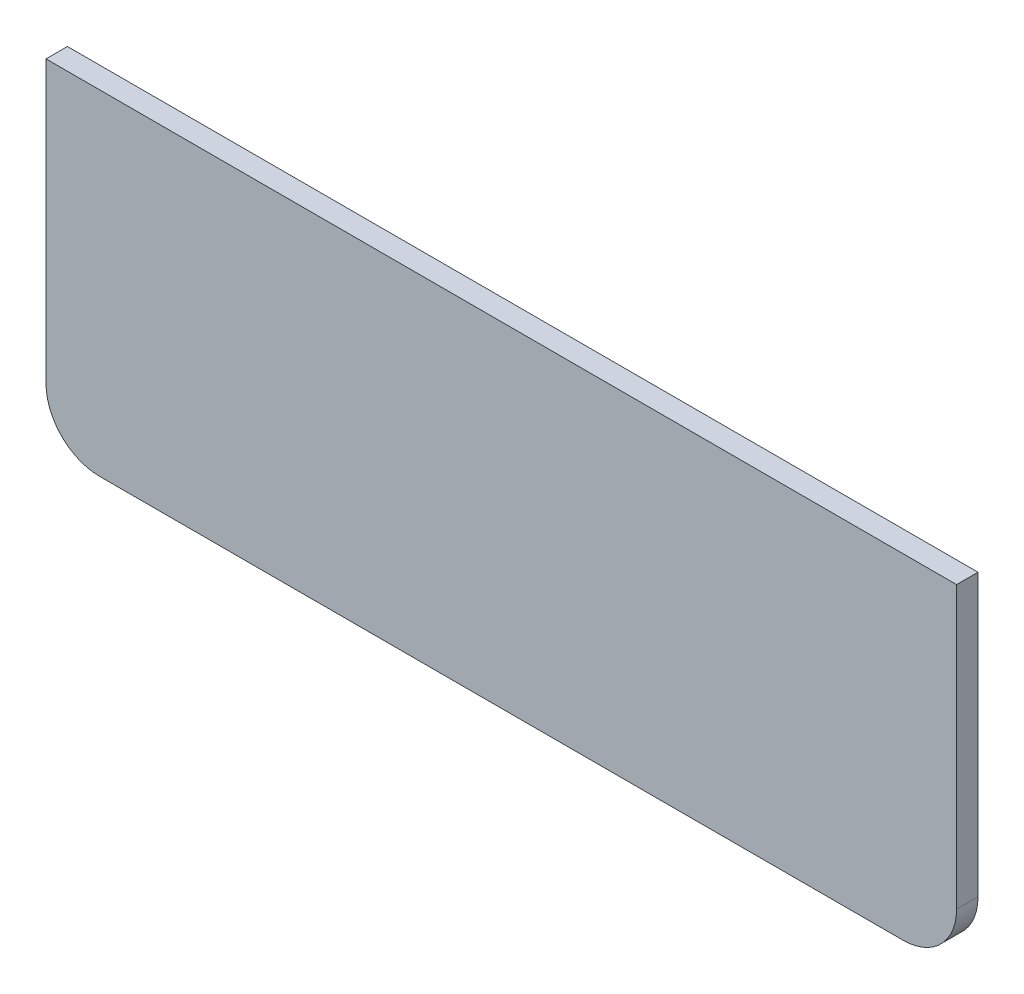
ISO-10303-21;
HEADER;
FILE_DESCRIPTION(('STEP AP214'),'2;1');
FILE_NAME('part.step','',(''),(''),'','','');
FILE_SCHEMA(('AUTOMOTIVE_DESIGN { 1 0 10303 214 1 1 1 1 }'));
ENDSEC;
DATA;
#1=APPLICATION_CONTEXT('core data for automotive mechanical design processes');
#2=APPLICATION_PROTOCOL_DEFINITION('international standard','automotive_design',2000,#1);
#3=PRODUCT_CONTEXT('',#1,'mechanical');
#4=PRODUCT('Part','Part','',(#3));
#5=PRODUCT_RELATED_PRODUCT_CATEGORY('part','',(#4));
#6=PRODUCT_DEFINITION_FORMATION('','',#4);
#7=PRODUCT_DEFINITION_CONTEXT('part definition',#1,'design');
#8=PRODUCT_DEFINITION('design','',#6,#7);
#9=PRODUCT_DEFINITION_SHAPE('','',#8);
#10=(LENGTH_UNIT() NAMED_UNIT(*) SI_UNIT(.MILLI.,.METRE.));
#11=(NAMED_UNIT(*) PLANE_ANGLE_UNIT() SI_UNIT($,.RADIAN.));
#12=(NAMED_UNIT(*) SI_UNIT($,.STERADIAN.) SOLID_ANGLE_UNIT());
#13=UNCERTAINTY_MEASURE_WITH_UNIT(LENGTH_MEASURE(1.E-05),#10,'distance_accuracy_value','');
#14=(GEOMETRIC_REPRESENTATION_CONTEXT(3) GLOBAL_UNCERTAINTY_ASSIGNED_CONTEXT((#13)) GLOBAL_UNIT_ASSIGNED_CONTEXT((#10,
#11,#12)) REPRESENTATION_CONTEXT('',''));
#15=CARTESIAN_POINT('',(0.,0.,0.));
#16=DIRECTION('',(0.,0.,1.));
#17=DIRECTION('',(1.,0.,0.));
#18=AXIS2_PLACEMENT_3D('',#15,#16,#17);
#19=CARTESIAN_POINT('',(34.,-8.5,1.6));
#20=DIRECTION('',(-1.,0.,0.));
#21=DIRECTION('',(0.,0.,1.));
#22=AXIS2_PLACEMENT_3D('',#19,#20,#21);
#23=PLANE('',#22);
#24=DIRECTION('',(0.,1.,0.));
#25=VECTOR('',#24,1.);
#26=CARTESIAN_POINT('',(34.,-8.5,0.));
#27=LINE('',#26,#25);
#28=CARTESIAN_POINT('',(34.,-8.5,0.));
#29=VERTEX_POINT('',#28);
#30=CARTESIAN_POINT('',(34.,12.5,0.));
#31=VERTEX_POINT('',#30);
#32=EDGE_CURVE('E119',#29,#31,#27,.T.);
#33=ORIENTED_EDGE('',*,*,#32,.T.);
#34=DIRECTION('',(0.,0.,-1.));
#35=VECTOR('',#34,1.);
#36=CARTESIAN_POINT('',(34.,12.5,1.6));
#37=LINE('',#36,#35);
#38=CARTESIAN_POINT('',(34.,12.5,1.6));
#39=VERTEX_POINT('',#38);
#40=EDGE_CURVE('E11',#39,#31,#37,.T.);
#41=ORIENTED_EDGE('',*,*,#40,.F.);
#42=DIRECTION('',(0.,1.,0.));
#43=VECTOR('',#42,1.);
#44=CARTESIAN_POINT('',(34.,-8.5,1.6));
#45=LINE('',#44,#43);
#46=CARTESIAN_POINT('',(34.,-8.5,1.6));
#47=VERTEX_POINT('',#46);
#48=EDGE_CURVE('E129',#47,#39,#45,.T.);
#49=ORIENTED_EDGE('',*,*,#48,.F.);
#50=DIRECTION('',(0.,0.,-1.));
#51=VECTOR('',#50,1.);
#52=CARTESIAN_POINT('',(34.,-8.5,1.6));
#53=LINE('',#52,#51);
#54=EDGE_CURVE('E115',#47,#29,#53,.T.);
#55=ORIENTED_EDGE('',*,*,#54,.T.);
#56=EDGE_LOOP('',(#33,#41,#49,#55));
#57=FACE_BOUND('',#56,.T.);
#58=ADVANCED_FACE('F35',(#57),#23,.F.);
#59=CARTESIAN_POINT('',(-34.,12.5,1.6));
#60=DIRECTION('',(0.,-1.,0.));
#61=DIRECTION('',(0.,0.,-1.));
#62=AXIS2_PLACEMENT_3D('',#59,#60,#61);
#63=PLANE('',#62);
#64=DIRECTION('',(-1.,0.,0.));
#65=VECTOR('',#64,1.);
#66=CARTESIAN_POINT('',(-34.,12.5,0.));
#67=LINE('',#66,#65);
#68=CARTESIAN_POINT('',(-34.,12.5,0.));
#69=VERTEX_POINT('',#68);
#70=EDGE_CURVE('E122',#31,#69,#67,.T.);
#71=ORIENTED_EDGE('',*,*,#70,.T.);
#72=DIRECTION('',(0.,0.,-1.));
#73=VECTOR('',#72,1.);
#74=CARTESIAN_POINT('',(-34.,12.5,1.6));
#75=LINE('',#74,#73);
#76=CARTESIAN_POINT('',(-34.,12.5,1.6));
#77=VERTEX_POINT('',#76);
#78=EDGE_CURVE('E43',#77,#69,#75,.T.);
#79=ORIENTED_EDGE('',*,*,#78,.F.);
#80=DIRECTION('',(-1.,0.,0.));
#81=VECTOR('',#80,1.);
#82=CARTESIAN_POINT('',(-34.,12.5,1.6));
#83=LINE('',#82,#81);
#84=EDGE_CURVE('E88',#39,#77,#83,.T.);
#85=ORIENTED_EDGE('',*,*,#84,.F.);
#86=ORIENTED_EDGE('',*,*,#40,.T.);
#87=EDGE_LOOP('',(#71,#79,#85,#86));
#88=FACE_BOUND('',#87,.T.);
#89=ADVANCED_FACE('F153',(#88),#63,.F.);
#90=CARTESIAN_POINT('',(-34.,-8.5,1.6));
#91=DIRECTION('',(1.,0.,0.));
#92=DIRECTION('',(0.,0.,-1.));
#93=AXIS2_PLACEMENT_3D('',#90,#91,#92);
#94=PLANE('',#93);
#95=DIRECTION('',(0.,-1.,0.));
#96=VECTOR('',#95,1.);
#97=CARTESIAN_POINT('',(-34.,-8.5,0.));
#98=LINE('',#97,#96);
#99=CARTESIAN_POINT('',(-34.,-8.5,0.));
#100=VERTEX_POINT('',#99);
#101=EDGE_CURVE('E124',#69,#100,#98,.T.);
#102=ORIENTED_EDGE('',*,*,#101,.T.);
#103=DIRECTION('',(0.,0.,-1.));
#104=VECTOR('',#103,1.);
#105=CARTESIAN_POINT('',(-34.,-8.5,1.6));
#106=LINE('',#105,#104);
#107=CARTESIAN_POINT('',(-34.,-8.5,1.6));
#108=VERTEX_POINT('',#107);
#109=EDGE_CURVE('E110',#108,#100,#106,.T.);
#110=ORIENTED_EDGE('',*,*,#109,.F.);
#111=DIRECTION('',(0.,-1.,0.));
#112=VECTOR('',#111,1.);
#113=CARTESIAN_POINT('',(-34.,-8.5,1.6));
#114=LINE('',#113,#112);
#115=EDGE_CURVE('E101',#77,#108,#114,.T.);
#116=ORIENTED_EDGE('',*,*,#115,.F.);
#117=ORIENTED_EDGE('',*,*,#78,.T.);
#118=EDGE_LOOP('',(#102,#110,#116,#117));
#119=FACE_BOUND('',#118,.T.);
#120=ADVANCED_FACE('F135',(#119),#94,.F.);
#121=CARTESIAN_POINT('',(-30.,-8.5,1.6));
#122=DIRECTION('',(0.,0.,-1.));
#123=DIRECTION('',(-1.,0.,0.));
#124=AXIS2_PLACEMENT_3D('',#121,#122,#123);
#125=CYLINDRICAL_SURFACE('',#124,4.);
#126=CARTESIAN_POINT('',(-30.,-8.5,0.));
#127=DIRECTION('',(0.,0.,1.));
#128=DIRECTION('',(-1.,0.,0.));
#129=AXIS2_PLACEMENT_3D('',#126,#127,#128);
#130=CIRCLE('',#129,4.);
#131=CARTESIAN_POINT('',(-30.,-12.5,0.));
#132=VERTEX_POINT('',#131);
#133=EDGE_CURVE('E109',#100,#132,#130,.T.);
#134=ORIENTED_EDGE('',*,*,#133,.T.);
#135=DIRECTION('',(0.,0.,-1.));
#136=VECTOR('',#135,1.);
#137=CARTESIAN_POINT('',(-30.,-12.5,1.6));
#138=LINE('',#137,#136);
#139=CARTESIAN_POINT('',(-30.,-12.5,1.6));
#140=VERTEX_POINT('',#139);
#141=EDGE_CURVE('E106',#140,#132,#138,.T.);
#142=ORIENTED_EDGE('',*,*,#141,.F.);
#143=CARTESIAN_POINT('',(-30.,-8.5,1.6));
#144=DIRECTION('',(0.,0.,1.));
#145=DIRECTION('',(-1.,0.,0.));
#146=AXIS2_PLACEMENT_3D('',#143,#144,#145);
#147=CIRCLE('',#146,4.);
#148=EDGE_CURVE('E95',#108,#140,#147,.T.);
#149=ORIENTED_EDGE('',*,*,#148,.F.);
#150=ORIENTED_EDGE('',*,*,#109,.T.);
#151=EDGE_LOOP('',(#134,#142,#149,#150));
#152=FACE_BOUND('',#151,.T.);
#153=ADVANCED_FACE('F107',(#152),#125,.T.);
#154=CARTESIAN_POINT('',(-30.,-12.5,1.6));
#155=DIRECTION('',(0.,1.,0.));
#156=DIRECTION('',(0.,0.,1.));
#157=AXIS2_PLACEMENT_3D('',#154,#155,#156);
#158=PLANE('',#157);
#159=DIRECTION('',(1.,0.,0.));
#160=VECTOR('',#159,1.);
#161=CARTESIAN_POINT('',(-30.,-12.5,0.));
#162=LINE('',#161,#160);
#163=CARTESIAN_POINT('',(30.,-12.5,0.));
#164=VERTEX_POINT('',#163);
#165=EDGE_CURVE('E74',#132,#164,#162,.T.);
#166=ORIENTED_EDGE('',*,*,#165,.T.);
#167=DIRECTION('',(0.,0.,-1.));
#168=VECTOR('',#167,1.);
#169=CARTESIAN_POINT('',(30.,-12.5,1.6));
#170=LINE('',#169,#168);
#171=CARTESIAN_POINT('',(30.,-12.5,1.6));
#172=VERTEX_POINT('',#171);
#173=EDGE_CURVE('E111',#172,#164,#170,.T.);
#174=ORIENTED_EDGE('',*,*,#173,.F.);
#175=DIRECTION('',(1.,0.,0.));
#176=VECTOR('',#175,1.);
#177=CARTESIAN_POINT('',(-30.,-12.5,1.6));
#178=LINE('',#177,#176);
#179=EDGE_CURVE('E99',#140,#172,#178,.T.);
#180=ORIENTED_EDGE('',*,*,#179,.F.);
#181=ORIENTED_EDGE('',*,*,#141,.T.);
#182=EDGE_LOOP('',(#166,#174,#180,#181));
#183=FACE_BOUND('',#182,.T.);
#184=ADVANCED_FACE('F113',(#183),#158,.F.);
#185=CARTESIAN_POINT('',(30.,-8.5,1.6));
#186=DIRECTION('',(0.,0.,-1.));
#187=DIRECTION('',(-1.,0.,0.));
#188=AXIS2_PLACEMENT_3D('',#185,#186,#187);
#189=CYLINDRICAL_SURFACE('',#188,4.);
#190=CARTESIAN_POINT('',(30.,-8.5,0.));
#191=DIRECTION('',(0.,0.,1.));
#192=DIRECTION('',(1.,0.,0.));
#193=AXIS2_PLACEMENT_3D('',#190,#191,#192);
#194=CIRCLE('',#193,4.);
#195=EDGE_CURVE('E80',#164,#29,#194,.T.);
#196=ORIENTED_EDGE('',*,*,#195,.T.);
#197=ORIENTED_EDGE('',*,*,#54,.F.);
#198=CARTESIAN_POINT('',(30.,-8.5,1.6));
#199=DIRECTION('',(0.,0.,1.));
#200=DIRECTION('',(1.,0.,0.));
#201=AXIS2_PLACEMENT_3D('',#198,#199,#200);
#202=CIRCLE('',#201,4.);
#203=EDGE_CURVE('E51',#172,#47,#202,.T.);
#204=ORIENTED_EDGE('',*,*,#203,.F.);
#205=ORIENTED_EDGE('',*,*,#173,.T.);
#206=EDGE_LOOP('',(#196,#197,#204,#205));
#207=FACE_BOUND('',#206,.T.);
#208=ADVANCED_FACE('F142',(#207),#189,.T.);
#209=CARTESIAN_POINT('',(-30.,-8.5,1.6));
#210=DIRECTION('',(0.,0.,-1.));
#211=DIRECTION('',(-1.,0.,0.));
#212=AXIS2_PLACEMENT_3D('',#209,#210,#211);
#213=PLANE('',#212);
#214=ORIENTED_EDGE('',*,*,#48,.T.);
#215=ORIENTED_EDGE('',*,*,#84,.T.);
#216=ORIENTED_EDGE('',*,*,#115,.T.);
#217=ORIENTED_EDGE('',*,*,#148,.T.);
#218=ORIENTED_EDGE('',*,*,#179,.T.);
#219=ORIENTED_EDGE('',*,*,#203,.T.);
#220=EDGE_LOOP('',(#214,#215,#216,#217,#218,#219));
#221=FACE_BOUND('',#220,.T.);
#222=ADVANCED_FACE('F97',(#221),#213,.F.);
#223=CARTESIAN_POINT('',(-30.,-8.5,0.));
#224=DIRECTION('',(0.,0.,-1.));
#225=DIRECTION('',(-1.,0.,0.));
#226=AXIS2_PLACEMENT_3D('',#223,#224,#225);
#227=PLANE('',#226);
#228=ORIENTED_EDGE('',*,*,#32,.F.);
#229=ORIENTED_EDGE('',*,*,#195,.F.);
#230=ORIENTED_EDGE('',*,*,#165,.F.);
#231=ORIENTED_EDGE('',*,*,#133,.F.);
#232=ORIENTED_EDGE('',*,*,#101,.F.);
#233=ORIENTED_EDGE('',*,*,#70,.F.);
#234=EDGE_LOOP('',(#228,#229,#230,#231,#232,#233));
#235=FACE_BOUND('',#234,.T.);
#236=ADVANCED_FACE('F138',(#235),#227,.T.);
#237=CLOSED_SHELL('',(#58,#89,#120,#153,#184,#208,#222,#236));
#238=MANIFOLD_SOLID_BREP('B2',#237);
#239=ADVANCED_BREP_SHAPE_REPRESENTATION('',(#18,#238),#14);
#240=SHAPE_DEFINITION_REPRESENTATION(#9,#239);
ENDSEC;
END-ISO-10303-21;
